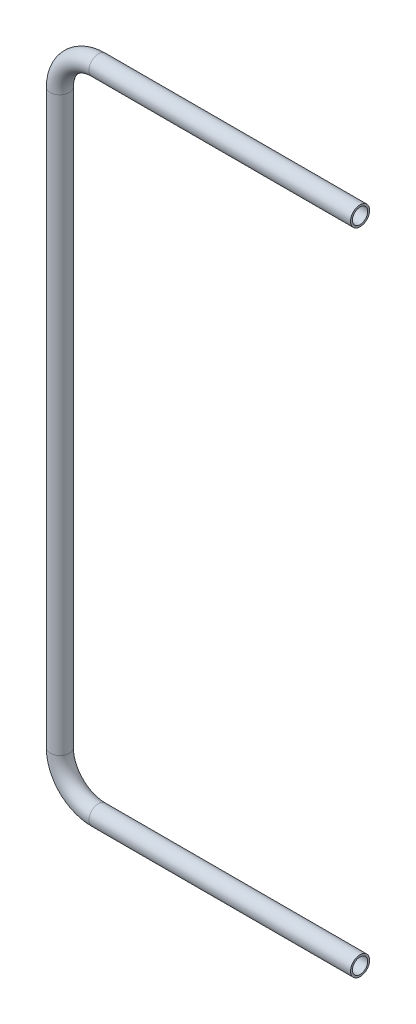
ISO-10303-21;
HEADER;
FILE_DESCRIPTION(('STEP AP214'),'2;1');
FILE_NAME('part.step','',(''),(''),'','','');
FILE_SCHEMA(('AUTOMOTIVE_DESIGN { 1 0 10303 214 1 1 1 1 }'));
ENDSEC;
DATA;
#1=APPLICATION_CONTEXT('core data for automotive mechanical design processes');
#2=APPLICATION_PROTOCOL_DEFINITION('international standard','automotive_design',2000,#1);
#3=PRODUCT_CONTEXT('',#1,'mechanical');
#4=PRODUCT('Part','Part','',(#3));
#5=PRODUCT_RELATED_PRODUCT_CATEGORY('part','',(#4));
#6=PRODUCT_DEFINITION_FORMATION('','',#4);
#7=PRODUCT_DEFINITION_CONTEXT('part definition',#1,'design');
#8=PRODUCT_DEFINITION('design','',#6,#7);
#9=PRODUCT_DEFINITION_SHAPE('','',#8);
#10=(LENGTH_UNIT() NAMED_UNIT(*) SI_UNIT(.MILLI.,.METRE.));
#11=(NAMED_UNIT(*) PLANE_ANGLE_UNIT() SI_UNIT($,.RADIAN.));
#12=(NAMED_UNIT(*) SI_UNIT($,.STERADIAN.) SOLID_ANGLE_UNIT());
#13=UNCERTAINTY_MEASURE_WITH_UNIT(LENGTH_MEASURE(1.E-05),#10,'distance_accuracy_value','');
#14=(GEOMETRIC_REPRESENTATION_CONTEXT(3) GLOBAL_UNCERTAINTY_ASSIGNED_CONTEXT((#13)) GLOBAL_UNIT_ASSIGNED_CONTEXT((#10,
#11,#12)) REPRESENTATION_CONTEXT('',''));
#15=CARTESIAN_POINT('',(0.,0.,0.));
#16=DIRECTION('',(0.,0.,1.));
#17=DIRECTION('',(1.,0.,0.));
#18=AXIS2_PLACEMENT_3D('',#15,#16,#17);
#19=CARTESIAN_POINT('',(0.,0.,0.));
#20=DIRECTION('',(-1.,0.,0.));
#21=DIRECTION('',(0.,-1.,0.));
#22=AXIS2_PLACEMENT_3D('',#19,#20,#21);
#23=CYLINDRICAL_SURFACE('',#22,16.7005);
#24=CARTESIAN_POINT('',(-457.2,0.,0.));
#25=DIRECTION('',(-1.,0.,0.));
#26=DIRECTION('',(0.,0.,1.));
#27=AXIS2_PLACEMENT_3D('',#24,#25,#26);
#28=CIRCLE('',#27,16.7005);
#29=CARTESIAN_POINT('',(-457.2,-16.7005000000001,0.));
#30=VERTEX_POINT('',#29);
#31=EDGE_CURVE('E99',#30,#30,#28,.T.);
#32=ORIENTED_EDGE('',*,*,#31,.F.);
#33=EDGE_LOOP('',(#32));
#34=FACE_BOUND('',#33,.T.);
#35=CARTESIAN_POINT('',(0.,0.,0.));
#36=DIRECTION('',(-1.,0.,0.));
#37=DIRECTION('',(0.,0.,1.));
#38=AXIS2_PLACEMENT_3D('',#35,#36,#37);
#39=CIRCLE('',#38,16.7005);
#40=CARTESIAN_POINT('',(0.,0.,16.7005));
#41=VERTEX_POINT('',#40);
#42=EDGE_CURVE('E61',#41,#41,#39,.T.);
#43=ORIENTED_EDGE('',*,*,#42,.T.);
#44=EDGE_LOOP('',(#43));
#45=FACE_BOUND('',#44,.T.);
#46=ADVANCED_FACE('F45',(#34,#45),#23,.T.);
#47=CARTESIAN_POINT('',(-457.2,67.5004999999999,0.));
#48=DIRECTION('',(0.,0.,1.));
#49=DIRECTION('',(-1.,0.,0.));
#50=AXIS2_PLACEMENT_3D('',#47,#48,#49);
#51=TOROIDAL_SURFACE('',#50,67.5005,16.7005);
#52=CARTESIAN_POINT('',(-524.7005,67.5004999999999,0.));
#53=DIRECTION('',(0.,1.,0.));
#54=DIRECTION('',(0.,0.,1.));
#55=AXIS2_PLACEMENT_3D('',#52,#53,#54);
#56=CIRCLE('',#55,16.7005);
#57=CARTESIAN_POINT('',(-541.401,67.5004999999999,0.));
#58=VERTEX_POINT('',#57);
#59=EDGE_CURVE('E103',#58,#58,#56,.T.);
#60=CARTESIAN_POINT('',(-457.2,67.5004999999999,0.));
#61=DIRECTION('',(0.,0.,1.));
#62=DIRECTION('',(-1.,0.,0.));
#63=AXIS2_PLACEMENT_3D('',#60,#61,#62);
#64=CIRCLE('',#63,84.201);
#65=EDGE_CURVE('',#58,#30,#64,.T.);
#66=ORIENTED_EDGE('',*,*,#59,.F.);
#67=ORIENTED_EDGE('',*,*,#31,.T.);
#68=ORIENTED_EDGE('',*,*,#65,.T.);
#69=ORIENTED_EDGE('',*,*,#65,.F.);
#70=EDGE_LOOP('',(#66,#68,#67,#69));
#71=FACE_BOUND('',#70,.T.);
#72=ADVANCED_FACE('F124',(#71),#51,.T.);
#73=CARTESIAN_POINT('',(-524.7005,67.5004999999999,0.));
#74=DIRECTION('',(0.,1.,0.));
#75=DIRECTION('',(-1.,0.,0.));
#76=AXIS2_PLACEMENT_3D('',#73,#74,#75);
#77=CYLINDRICAL_SURFACE('',#76,16.7005);
#78=CARTESIAN_POINT('',(-524.7005,1067.562,0.));
#79=DIRECTION('',(0.,1.,0.));
#80=DIRECTION('',(0.,0.,1.));
#81=AXIS2_PLACEMENT_3D('',#78,#79,#80);
#82=CIRCLE('',#81,16.7005);
#83=CARTESIAN_POINT('',(-541.401,1067.562,0.));
#84=VERTEX_POINT('',#83);
#85=EDGE_CURVE('E106',#84,#84,#82,.T.);
#86=ORIENTED_EDGE('',*,*,#85,.F.);
#87=EDGE_LOOP('',(#86));
#88=FACE_BOUND('',#87,.T.);
#89=ORIENTED_EDGE('',*,*,#59,.T.);
#90=EDGE_LOOP('',(#89));
#91=FACE_BOUND('',#90,.T.);
#92=ADVANCED_FACE('F118',(#88,#91),#77,.T.);
#93=CARTESIAN_POINT('',(-457.2,1067.562,0.));
#94=DIRECTION('',(0.,0.,1.));
#95=DIRECTION('',(-1.,0.,0.));
#96=AXIS2_PLACEMENT_3D('',#93,#94,#95);
#97=TOROIDAL_SURFACE('',#96,67.5005,16.7005);
#98=CARTESIAN_POINT('',(-457.2,1135.0625,0.));
#99=DIRECTION('',(1.,0.,0.));
#100=DIRECTION('',(0.,0.,1.));
#101=AXIS2_PLACEMENT_3D('',#98,#99,#100);
#102=CIRCLE('',#101,16.7005);
#103=CARTESIAN_POINT('',(-457.2,1151.763,0.));
#104=VERTEX_POINT('',#103);
#105=EDGE_CURVE('E49',#104,#104,#102,.T.);
#106=CARTESIAN_POINT('',(-457.2,1067.562,0.));
#107=DIRECTION('',(0.,0.,1.));
#108=DIRECTION('',(-1.,0.,0.));
#109=AXIS2_PLACEMENT_3D('',#106,#107,#108);
#110=CIRCLE('',#109,84.201);
#111=EDGE_CURVE('',#104,#84,#110,.T.);
#112=ORIENTED_EDGE('',*,*,#105,.F.);
#113=ORIENTED_EDGE('',*,*,#85,.T.);
#114=ORIENTED_EDGE('',*,*,#111,.T.);
#115=ORIENTED_EDGE('',*,*,#111,.F.);
#116=EDGE_LOOP('',(#112,#114,#113,#115));
#117=FACE_BOUND('',#116,.T.);
#118=ADVANCED_FACE('F116',(#117),#97,.T.);
#119=CARTESIAN_POINT('',(-457.2,1135.0625,0.));
#120=DIRECTION('',(1.,0.,0.));
#121=DIRECTION('',(0.,1.,0.));
#122=AXIS2_PLACEMENT_3D('',#119,#120,#121);
#123=CYLINDRICAL_SURFACE('',#122,16.7005);
#124=CARTESIAN_POINT('',(-3.33066907387547E-13,1135.0625,0.));
#125=DIRECTION('',(1.,0.,0.));
#126=DIRECTION('',(0.,0.,1.));
#127=AXIS2_PLACEMENT_3D('',#124,#125,#126);
#128=CIRCLE('',#127,16.7005);
#129=CARTESIAN_POINT('',(-3.33066907387547E-13,1135.0625,16.7005));
#130=VERTEX_POINT('',#129);
#131=EDGE_CURVE('E66',#130,#130,#128,.T.);
#132=ORIENTED_EDGE('',*,*,#131,.F.);
#133=EDGE_LOOP('',(#132));
#134=FACE_BOUND('',#133,.T.);
#135=ORIENTED_EDGE('',*,*,#105,.T.);
#136=EDGE_LOOP('',(#135));
#137=FACE_BOUND('',#136,.T.);
#138=ADVANCED_FACE('F47',(#134,#137),#123,.T.);
#139=CARTESIAN_POINT('',(0.,0.,0.));
#140=DIRECTION('',(1.,0.,0.));
#141=DIRECTION('',(0.,0.,1.));
#142=AXIS2_PLACEMENT_3D('',#139,#140,#141);
#143=PLANE('',#142);
#144=CARTESIAN_POINT('',(0.,0.,0.));
#145=DIRECTION('',(-1.,0.,0.));
#146=DIRECTION('',(0.,0.,1.));
#147=AXIS2_PLACEMENT_3D('',#144,#145,#146);
#148=CIRCLE('',#147,13.335);
#149=CARTESIAN_POINT('',(0.,0.,13.335));
#150=VERTEX_POINT('',#149);
#151=EDGE_CURVE('E96',#150,#150,#148,.F.);
#152=ORIENTED_EDGE('',*,*,#151,.F.);
#153=EDGE_LOOP('',(#152));
#154=FACE_BOUND('',#153,.T.);
#155=ORIENTED_EDGE('',*,*,#42,.F.);
#156=EDGE_LOOP('',(#155));
#157=FACE_BOUND('',#156,.T.);
#158=ADVANCED_FACE('F122',(#154,#157),#143,.T.);
#159=CARTESIAN_POINT('',(-3.33066907387547E-13,1135.0625,0.));
#160=DIRECTION('',(-1.,0.,0.));
#161=DIRECTION('',(0.,0.,1.));
#162=AXIS2_PLACEMENT_3D('',#159,#160,#161);
#163=PLANE('',#162);
#164=CARTESIAN_POINT('',(-3.33066907387547E-13,1135.0625,0.));
#165=DIRECTION('',(1.,0.,0.));
#166=DIRECTION('',(0.,0.,1.));
#167=AXIS2_PLACEMENT_3D('',#164,#165,#166);
#168=CIRCLE('',#167,13.335);
#169=CARTESIAN_POINT('',(-3.33066907387547E-13,1135.0625,13.335));
#170=VERTEX_POINT('',#169);
#171=EDGE_CURVE('E11',#170,#170,#168,.F.);
#172=ORIENTED_EDGE('',*,*,#171,.T.);
#173=EDGE_LOOP('',(#172));
#174=FACE_BOUND('',#173,.T.);
#175=ORIENTED_EDGE('',*,*,#131,.T.);
#176=EDGE_LOOP('',(#175));
#177=FACE_BOUND('',#176,.T.);
#178=ADVANCED_FACE('F73',(#174,#177),#163,.F.);
#179=CARTESIAN_POINT('',(0.,0.,0.));
#180=DIRECTION('',(-1.,0.,0.));
#181=DIRECTION('',(0.,-1.,0.));
#182=AXIS2_PLACEMENT_3D('',#179,#180,#181);
#183=CYLINDRICAL_SURFACE('',#182,13.335);
#184=CARTESIAN_POINT('',(-457.2,0.,0.));
#185=DIRECTION('',(-1.,0.,0.));
#186=DIRECTION('',(0.,0.,1.));
#187=AXIS2_PLACEMENT_3D('',#184,#185,#186);
#188=CIRCLE('',#187,13.335);
#189=CARTESIAN_POINT('',(-457.2,-13.3350000000001,0.));
#190=VERTEX_POINT('',#189);
#191=EDGE_CURVE('E158',#190,#190,#188,.F.);
#192=ORIENTED_EDGE('',*,*,#191,.F.);
#193=EDGE_LOOP('',(#192));
#194=FACE_BOUND('',#193,.T.);
#195=ORIENTED_EDGE('',*,*,#151,.T.);
#196=EDGE_LOOP('',(#195));
#197=FACE_BOUND('',#196,.T.);
#198=ADVANCED_FACE('F140',(#194,#197),#183,.F.);
#199=CARTESIAN_POINT('',(-457.2,67.5004999999999,0.));
#200=DIRECTION('',(0.,0.,1.));
#201=DIRECTION('',(-1.,0.,0.));
#202=AXIS2_PLACEMENT_3D('',#199,#200,#201);
#203=TOROIDAL_SURFACE('',#202,67.5005,13.335);
#204=CARTESIAN_POINT('',(-524.7005,67.5004999999999,0.));
#205=DIRECTION('',(0.,1.,0.));
#206=DIRECTION('',(0.,0.,1.));
#207=AXIS2_PLACEMENT_3D('',#204,#205,#206);
#208=CIRCLE('',#207,13.335);
#209=CARTESIAN_POINT('',(-538.0355,67.5004999999999,0.));
#210=VERTEX_POINT('',#209);
#211=EDGE_CURVE('E90',#210,#210,#208,.F.);
#212=CARTESIAN_POINT('',(-457.2,67.5004999999999,0.));
#213=DIRECTION('',(0.,0.,1.));
#214=DIRECTION('',(-1.,0.,0.));
#215=AXIS2_PLACEMENT_3D('',#212,#213,#214);
#216=CIRCLE('',#215,80.8355);
#217=EDGE_CURVE('',#210,#190,#216,.T.);
#218=ORIENTED_EDGE('',*,*,#211,.F.);
#219=ORIENTED_EDGE('',*,*,#191,.T.);
#220=ORIENTED_EDGE('',*,*,#217,.T.);
#221=ORIENTED_EDGE('',*,*,#217,.F.);
#222=EDGE_LOOP('',(#218,#220,#219,#221));
#223=FACE_BOUND('',#222,.T.);
#224=ADVANCED_FACE('F147',(#223),#203,.F.);
#225=CARTESIAN_POINT('',(-524.7005,67.5004999999999,0.));
#226=DIRECTION('',(0.,1.,0.));
#227=DIRECTION('',(-1.,0.,0.));
#228=AXIS2_PLACEMENT_3D('',#225,#226,#227);
#229=CYLINDRICAL_SURFACE('',#228,13.335);
#230=CARTESIAN_POINT('',(-524.7005,1067.562,0.));
#231=DIRECTION('',(0.,1.,0.));
#232=DIRECTION('',(0.,0.,1.));
#233=AXIS2_PLACEMENT_3D('',#230,#231,#232);
#234=CIRCLE('',#233,13.335);
#235=CARTESIAN_POINT('',(-538.0355,1067.562,0.));
#236=VERTEX_POINT('',#235);
#237=EDGE_CURVE('E84',#236,#236,#234,.F.);
#238=ORIENTED_EDGE('',*,*,#237,.F.);
#239=EDGE_LOOP('',(#238));
#240=FACE_BOUND('',#239,.T.);
#241=ORIENTED_EDGE('',*,*,#211,.T.);
#242=EDGE_LOOP('',(#241));
#243=FACE_BOUND('',#242,.T.);
#244=ADVANCED_FACE('F144',(#240,#243),#229,.F.);
#245=CARTESIAN_POINT('',(-457.2,1067.562,0.));
#246=DIRECTION('',(0.,0.,1.));
#247=DIRECTION('',(-1.,0.,0.));
#248=AXIS2_PLACEMENT_3D('',#245,#246,#247);
#249=TOROIDAL_SURFACE('',#248,67.5005,13.335);
#250=CARTESIAN_POINT('',(-457.2,1135.0625,0.));
#251=DIRECTION('',(1.,0.,0.));
#252=DIRECTION('',(0.,0.,1.));
#253=AXIS2_PLACEMENT_3D('',#250,#251,#252);
#254=CIRCLE('',#253,13.335);
#255=CARTESIAN_POINT('',(-457.2,1148.3975,0.));
#256=VERTEX_POINT('',#255);
#257=EDGE_CURVE('E55',#256,#256,#254,.F.);
#258=CARTESIAN_POINT('',(-457.2,1067.562,0.));
#259=DIRECTION('',(0.,0.,1.));
#260=DIRECTION('',(-1.,0.,0.));
#261=AXIS2_PLACEMENT_3D('',#258,#259,#260);
#262=CIRCLE('',#261,80.8355);
#263=EDGE_CURVE('',#256,#236,#262,.T.);
#264=ORIENTED_EDGE('',*,*,#257,.F.);
#265=ORIENTED_EDGE('',*,*,#237,.T.);
#266=ORIENTED_EDGE('',*,*,#263,.T.);
#267=ORIENTED_EDGE('',*,*,#263,.F.);
#268=EDGE_LOOP('',(#264,#266,#265,#267));
#269=FACE_BOUND('',#268,.T.);
#270=ADVANCED_FACE('F78',(#269),#249,.F.);
#271=CARTESIAN_POINT('',(-457.2,1135.0625,0.));
#272=DIRECTION('',(1.,0.,0.));
#273=DIRECTION('',(0.,1.,0.));
#274=AXIS2_PLACEMENT_3D('',#271,#272,#273);
#275=CYLINDRICAL_SURFACE('',#274,13.335);
#276=ORIENTED_EDGE('',*,*,#171,.F.);
#277=EDGE_LOOP('',(#276));
#278=FACE_BOUND('',#277,.T.);
#279=ORIENTED_EDGE('',*,*,#257,.T.);
#280=EDGE_LOOP('',(#279));
#281=FACE_BOUND('',#280,.T.);
#282=ADVANCED_FACE('F75',(#278,#281),#275,.F.);
#283=CLOSED_SHELL('',(#46,#72,#92,#118,#138,#158,#178,#198,#224,#244,#270,#282));
#284=MANIFOLD_SOLID_BREP('B2',#283);
#285=ADVANCED_BREP_SHAPE_REPRESENTATION('',(#18,#284),#14);
#286=SHAPE_DEFINITION_REPRESENTATION(#9,#285);
ENDSEC;
END-ISO-10303-21;
